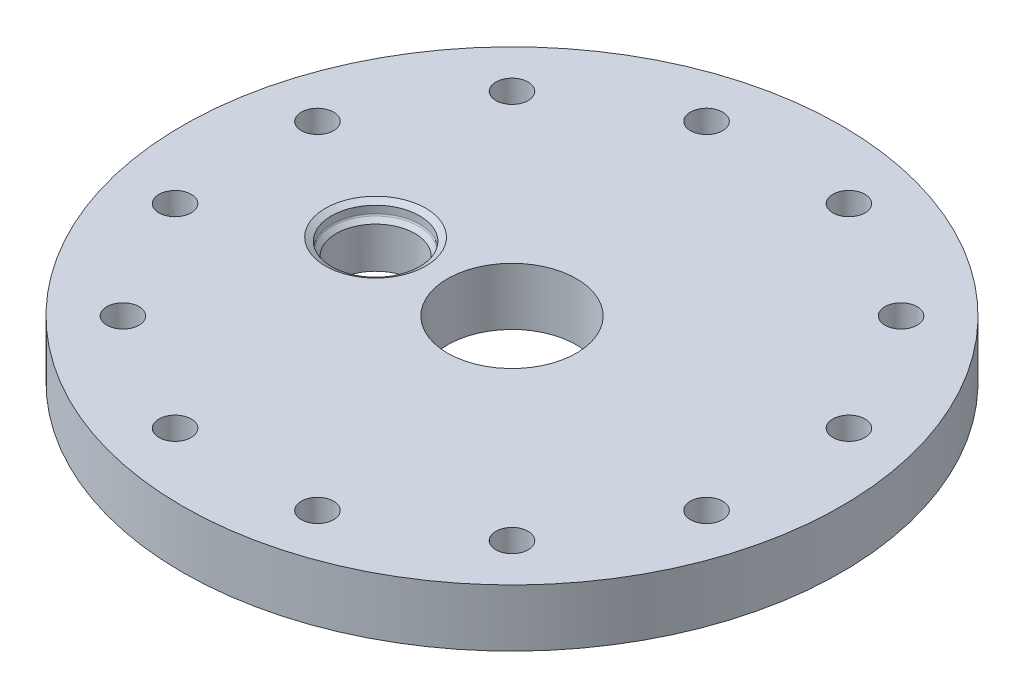
ISO-10303-21;
HEADER;
FILE_DESCRIPTION(('STEP AP214'),'2;1');
FILE_NAME('part.step','',(''),(''),'','','');
FILE_SCHEMA(('AUTOMOTIVE_DESIGN { 1 0 10303 214 1 1 1 1 }'));
ENDSEC;
DATA;
#1=APPLICATION_CONTEXT('core data for automotive mechanical design processes');
#2=APPLICATION_PROTOCOL_DEFINITION('international standard','automotive_design',2000,#1);
#3=PRODUCT_CONTEXT('',#1,'mechanical');
#4=PRODUCT('Part','Part','',(#3));
#5=PRODUCT_RELATED_PRODUCT_CATEGORY('part','',(#4));
#6=PRODUCT_DEFINITION_FORMATION('','',#4);
#7=PRODUCT_DEFINITION_CONTEXT('part definition',#1,'design');
#8=PRODUCT_DEFINITION('design','',#6,#7);
#9=PRODUCT_DEFINITION_SHAPE('','',#8);
#10=(LENGTH_UNIT() NAMED_UNIT(*) SI_UNIT(.MILLI.,.METRE.));
#11=(NAMED_UNIT(*) PLANE_ANGLE_UNIT() SI_UNIT($,.RADIAN.));
#12=(NAMED_UNIT(*) SI_UNIT($,.STERADIAN.) SOLID_ANGLE_UNIT());
#13=UNCERTAINTY_MEASURE_WITH_UNIT(LENGTH_MEASURE(1.E-05),#10,'distance_accuracy_value','');
#14=(GEOMETRIC_REPRESENTATION_CONTEXT(3) GLOBAL_UNCERTAINTY_ASSIGNED_CONTEXT((#13)) GLOBAL_UNIT_ASSIGNED_CONTEXT((#10,
#11,#12)) REPRESENTATION_CONTEXT('',''));
#15=CARTESIAN_POINT('',(0.,0.,0.));
#16=DIRECTION('',(0.,0.,1.));
#17=DIRECTION('',(1.,0.,0.));
#18=AXIS2_PLACEMENT_3D('',#15,#16,#17);
#19=CARTESIAN_POINT('',(-30.226,-0.000999999999999265,0.));
#20=DIRECTION('',(0.,1.,0.));
#21=DIRECTION('',(0.,0.,1.));
#22=AXIS2_PLACEMENT_3D('',#19,#20,#21);
#23=CYLINDRICAL_SURFACE('',#22,8.71220000000001);
#24=CARTESIAN_POINT('',(-30.226,0.,0.));
#25=DIRECTION('',(0.,1.,0.));
#26=DIRECTION('',(0.,0.,1.));
#27=AXIS2_PLACEMENT_3D('',#24,#25,#26);
#28=CIRCLE('',#27,8.71220000000001);
#29=CARTESIAN_POINT('',(-30.226,0.,8.71220000000001));
#30=VERTEX_POINT('',#29);
#31=EDGE_CURVE('E143',#30,#30,#28,.F.);
#32=ORIENTED_EDGE('',*,*,#31,.T.);
#33=EDGE_LOOP('',(#32));
#34=FACE_BOUND('',#33,.T.);
#35=CARTESIAN_POINT('',(-30.226,9.04787951031445,0.));
#36=DIRECTION('',(0.,-1.,0.));
#37=DIRECTION('',(0.,0.,-1.));
#38=AXIS2_PLACEMENT_3D('',#35,#36,#37);
#39=CIRCLE('',#38,8.71219999999999);
#40=CARTESIAN_POINT('',(-30.226,9.04787951031445,-8.71219999999999));
#41=VERTEX_POINT('',#40);
#42=EDGE_CURVE('E147',#41,#41,#39,.T.);
#43=ORIENTED_EDGE('',*,*,#42,.F.);
#44=EDGE_LOOP('',(#43));
#45=FACE_BOUND('',#44,.T.);
#46=ADVANCED_FACE('F50',(#34,#45),#23,.F.);
#47=CARTESIAN_POINT('',(0.,12.7,0.));
#48=DIRECTION('',(0.,-1.,0.));
#49=DIRECTION('',(0.,0.,-1.));
#50=AXIS2_PLACEMENT_3D('',#47,#48,#49);
#51=CYLINDRICAL_SURFACE('',#50,73.025);
#52=CARTESIAN_POINT('',(0.,12.7,0.));
#53=DIRECTION('',(0.,1.,0.));
#54=DIRECTION('',(0.,0.,1.));
#55=AXIS2_PLACEMENT_3D('',#52,#53,#54);
#56=CIRCLE('',#55,73.025);
#57=CARTESIAN_POINT('',(0.,12.7,73.025));
#58=VERTEX_POINT('',#57);
#59=EDGE_CURVE('E12',#58,#58,#56,.T.);
#60=ORIENTED_EDGE('',*,*,#59,.F.);
#61=EDGE_LOOP('',(#60));
#62=FACE_BOUND('',#61,.T.);
#63=CARTESIAN_POINT('',(0.,0.,0.));
#64=DIRECTION('',(0.,1.,0.));
#65=DIRECTION('',(0.,0.,1.));
#66=AXIS2_PLACEMENT_3D('',#63,#64,#65);
#67=CIRCLE('',#66,73.025);
#68=CARTESIAN_POINT('',(0.,0.,73.025));
#69=VERTEX_POINT('',#68);
#70=EDGE_CURVE('E54',#69,#69,#67,.T.);
#71=ORIENTED_EDGE('',*,*,#70,.T.);
#72=EDGE_LOOP('',(#71));
#73=FACE_BOUND('',#72,.T.);
#74=ADVANCED_FACE('F52',(#62,#73),#51,.T.);
#75=CARTESIAN_POINT('',(0.,12.7,0.));
#76=DIRECTION('',(0.,1.,0.));
#77=DIRECTION('',(0.,0.,1.));
#78=AXIS2_PLACEMENT_3D('',#75,#76,#77);
#79=PLANE('',#78);
#80=CARTESIAN_POINT('',(-30.226,12.7,0.));
#81=DIRECTION('',(0.,-1.,0.));
#82=DIRECTION('',(0.,0.,-1.));
#83=AXIS2_PLACEMENT_3D('',#80,#81,#82);
#84=CIRCLE('',#83,11.1125);
#85=CARTESIAN_POINT('',(-30.226,12.7,-11.1125));
#86=VERTEX_POINT('',#85);
#87=EDGE_CURVE('E159',#86,#86,#84,.T.);
#88=ORIENTED_EDGE('',*,*,#87,.T.);
#89=EDGE_LOOP('',(#88));
#90=FACE_BOUND('',#89,.T.);
#91=CARTESIAN_POINT('',(-58.8828383705818,12.7,15.7776089894489));
#92=DIRECTION('',(0.,1.,0.));
#93=DIRECTION('',(0.499999999999989,0.,0.866025403784445));
#94=AXIS2_PLACEMENT_3D('',#91,#92,#93);
#95=CIRCLE('',#94,3.571875);
#96=CARTESIAN_POINT('',(-57.0969008705819,12.7,18.8709434785914));
#97=VERTEX_POINT('',#96);
#98=EDGE_CURVE('E140',#97,#97,#95,.T.);
#99=ORIENTED_EDGE('',*,*,#98,.F.);
#100=EDGE_LOOP('',(#99));
#101=FACE_BOUND('',#100,.T.);
#102=CARTESIAN_POINT('',(-43.1052293811325,12.7,43.1052293811314));
#103=DIRECTION('',(0.,1.,0.));
#104=DIRECTION('',(0.866025403784433,0.,0.50000000000001));
#105=AXIS2_PLACEMENT_3D('',#102,#103,#104);
#106=CIRCLE('',#105,3.571875);
#107=CARTESIAN_POINT('',(-40.0118948919899,12.7,44.8911668811314));
#108=VERTEX_POINT('',#107);
#109=EDGE_CURVE('E132',#108,#108,#106,.T.);
#110=ORIENTED_EDGE('',*,*,#109,.F.);
#111=EDGE_LOOP('',(#110));
#112=FACE_BOUND('',#111,.T.);
#113=CARTESIAN_POINT('',(-15.7776089894503,12.7,58.8828383705814));
#114=DIRECTION('',(0.,1.,0.));
#115=DIRECTION('',(1.,0.,0.));
#116=AXIS2_PLACEMENT_3D('',#113,#114,#115);
#117=CIRCLE('',#116,3.571875);
#118=CARTESIAN_POINT('',(-12.2057339894503,12.7,58.8828383705815));
#119=VERTEX_POINT('',#118);
#120=EDGE_CURVE('E126',#119,#119,#117,.T.);
#121=ORIENTED_EDGE('',*,*,#120,.F.);
#122=EDGE_LOOP('',(#121));
#123=FACE_BOUND('',#122,.T.);
#124=CARTESIAN_POINT('',(15.7776089894491,12.7,58.8828383705818));
#125=DIRECTION('',(0.,1.,0.));
#126=DIRECTION('',(0.866025403784443,0.,-0.499999999999992));
#127=AXIS2_PLACEMENT_3D('',#124,#125,#126);
#128=CIRCLE('',#127,3.571875);
#129=CARTESIAN_POINT('',(18.8709434785916,12.7,57.0969008705818));
#130=VERTEX_POINT('',#129);
#131=EDGE_CURVE('E120',#130,#130,#128,.T.);
#132=ORIENTED_EDGE('',*,*,#131,.F.);
#133=EDGE_LOOP('',(#132));
#134=FACE_BOUND('',#133,.T.);
#135=CARTESIAN_POINT('',(43.1052293811316,12.7,43.1052293811323));
#136=DIRECTION('',(0.,1.,0.));
#137=DIRECTION('',(0.500000000000007,0.,-0.866025403784435));
#138=AXIS2_PLACEMENT_3D('',#135,#136,#137);
#139=CIRCLE('',#138,3.571875);
#140=CARTESIAN_POINT('',(44.8911668811316,12.7,40.0118948919898));
#141=VERTEX_POINT('',#140);
#142=EDGE_CURVE('E114',#141,#141,#139,.T.);
#143=ORIENTED_EDGE('',*,*,#142,.F.);
#144=EDGE_LOOP('',(#143));
#145=FACE_BOUND('',#144,.T.);
#146=CARTESIAN_POINT('',(58.8828383705815,12.7,15.7776089894501));
#147=DIRECTION('',(0.,1.,0.));
#148=DIRECTION('',(0.,0.,-1.));
#149=AXIS2_PLACEMENT_3D('',#146,#147,#148);
#150=CIRCLE('',#149,3.571875);
#151=CARTESIAN_POINT('',(58.8828383705815,12.7,12.2057339894501));
#152=VERTEX_POINT('',#151);
#153=EDGE_CURVE('E108',#152,#152,#150,.T.);
#154=ORIENTED_EDGE('',*,*,#153,.F.);
#155=EDGE_LOOP('',(#154));
#156=FACE_BOUND('',#155,.T.);
#157=CARTESIAN_POINT('',(58.8828383705817,12.7,-15.7776089894493));
#158=DIRECTION('',(0.,1.,0.));
#159=DIRECTION('',(-0.499999999999995,0.,-0.866025403784442));
#160=AXIS2_PLACEMENT_3D('',#157,#158,#159);
#161=CIRCLE('',#160,3.571875);
#162=CARTESIAN_POINT('',(57.0969008705817,12.7,-18.8709434785918));
#163=VERTEX_POINT('',#162);
#164=EDGE_CURVE('E102',#163,#163,#161,.T.);
#165=ORIENTED_EDGE('',*,*,#164,.F.);
#166=EDGE_LOOP('',(#165));
#167=FACE_BOUND('',#166,.T.);
#168=CARTESIAN_POINT('',(43.1052293811322,12.7,-43.1052293811317));
#169=DIRECTION('',(0.,1.,0.));
#170=DIRECTION('',(-0.866025403784436,0.,-0.500000000000004));
#171=AXIS2_PLACEMENT_3D('',#168,#169,#170);
#172=CIRCLE('',#171,3.571875);
#173=CARTESIAN_POINT('',(40.0118948919896,12.7,-44.8911668811317));
#174=VERTEX_POINT('',#173);
#175=EDGE_CURVE('E96',#174,#174,#172,.T.);
#176=ORIENTED_EDGE('',*,*,#175,.F.);
#177=EDGE_LOOP('',(#176));
#178=FACE_BOUND('',#177,.T.);
#179=CARTESIAN_POINT('',(15.7776089894499,12.7,-58.8828383705815));
#180=DIRECTION('',(0.,1.,0.));
#181=DIRECTION('',(-1.,0.,0.));
#182=AXIS2_PLACEMENT_3D('',#179,#180,#181);
#183=CIRCLE('',#182,3.571875);
#184=CARTESIAN_POINT('',(12.2057339894499,12.7,-58.8828383705816));
#185=VERTEX_POINT('',#184);
#186=EDGE_CURVE('E90',#185,#185,#183,.T.);
#187=ORIENTED_EDGE('',*,*,#186,.F.);
#188=EDGE_LOOP('',(#187));
#189=FACE_BOUND('',#188,.T.);
#190=CARTESIAN_POINT('',(-15.7776089894495,12.7,-58.8828383705817));
#191=DIRECTION('',(0.,1.,0.));
#192=DIRECTION('',(-0.86602540378444,0.,0.499999999999998));
#193=AXIS2_PLACEMENT_3D('',#190,#191,#192);
#194=CIRCLE('',#193,3.571875);
#195=CARTESIAN_POINT('',(-18.870943478592,12.7,-57.0969008705817));
#196=VERTEX_POINT('',#195);
#197=EDGE_CURVE('E84',#196,#196,#194,.T.);
#198=ORIENTED_EDGE('',*,*,#197,.F.);
#199=EDGE_LOOP('',(#198));
#200=FACE_BOUND('',#199,.T.);
#201=CARTESIAN_POINT('',(-43.1052293811319,12.7,-43.105229381132));
#202=DIRECTION('',(0.,1.,0.));
#203=DIRECTION('',(-0.500000000000001,0.,0.866025403784438));
#204=AXIS2_PLACEMENT_3D('',#201,#202,#203);
#205=CIRCLE('',#204,3.571875);
#206=CARTESIAN_POINT('',(-44.8911668811319,12.7,-40.0118948919895));
#207=VERTEX_POINT('',#206);
#208=EDGE_CURVE('E78',#207,#207,#205,.T.);
#209=ORIENTED_EDGE('',*,*,#208,.F.);
#210=EDGE_LOOP('',(#209));
#211=FACE_BOUND('',#210,.T.);
#212=CARTESIAN_POINT('',(-58.8828383705816,12.7,-15.7776089894497));
#213=DIRECTION('',(0.,1.,0.));
#214=DIRECTION('',(0.,0.,1.));
#215=AXIS2_PLACEMENT_3D('',#212,#213,#214);
#216=CIRCLE('',#215,3.571875);
#217=CARTESIAN_POINT('',(-58.8828383705816,12.7,-12.2057339894497));
#218=VERTEX_POINT('',#217);
#219=EDGE_CURVE('E72',#218,#218,#216,.T.);
#220=ORIENTED_EDGE('',*,*,#219,.F.);
#221=EDGE_LOOP('',(#220));
#222=FACE_BOUND('',#221,.T.);
#223=CARTESIAN_POINT('',(0.,12.7,0.));
#224=DIRECTION('',(0.,1.,0.));
#225=DIRECTION('',(0.,0.,1.));
#226=AXIS2_PLACEMENT_3D('',#223,#224,#225);
#227=CIRCLE('',#226,14.2875);
#228=CARTESIAN_POINT('',(0.,12.7,14.2875));
#229=VERTEX_POINT('',#228);
#230=EDGE_CURVE('E63',#229,#229,#227,.T.);
#231=ORIENTED_EDGE('',*,*,#230,.F.);
#232=EDGE_LOOP('',(#231));
#233=FACE_BOUND('',#232,.T.);
#234=ORIENTED_EDGE('',*,*,#59,.T.);
#235=EDGE_LOOP('',(#234));
#236=FACE_BOUND('',#235,.T.);
#237=ADVANCED_FACE('F163',(#90,#101,#112,#123,#134,#145,#156,#167,#178,#189,#200,#211,#222,#233,
#236),#79,.T.);
#238=CARTESIAN_POINT('',(0.,0.,0.));
#239=DIRECTION('',(0.,1.,0.));
#240=DIRECTION('',(0.,0.,1.));
#241=AXIS2_PLACEMENT_3D('',#238,#239,#240);
#242=PLANE('',#241);
#243=ORIENTED_EDGE('',*,*,#31,.F.);
#244=EDGE_LOOP('',(#243));
#245=FACE_BOUND('',#244,.T.);
#246=CARTESIAN_POINT('',(-58.8828383705818,0.,15.7776089894489));
#247=DIRECTION('',(0.,1.,0.));
#248=DIRECTION('',(0.,0.,1.));
#249=AXIS2_PLACEMENT_3D('',#246,#247,#248);
#250=CIRCLE('',#249,3.571875);
#251=CARTESIAN_POINT('',(-58.8828383705818,0.,19.3494839894489));
#252=VERTEX_POINT('',#251);
#253=EDGE_CURVE('E136',#252,#252,#250,.F.);
#254=ORIENTED_EDGE('',*,*,#253,.F.);
#255=EDGE_LOOP('',(#254));
#256=FACE_BOUND('',#255,.T.);
#257=CARTESIAN_POINT('',(-43.1052293811325,0.,43.1052293811314));
#258=DIRECTION('',(0.,1.,0.));
#259=DIRECTION('',(0.,0.,1.));
#260=AXIS2_PLACEMENT_3D('',#257,#258,#259);
#261=CIRCLE('',#260,3.571875);
#262=CARTESIAN_POINT('',(-43.1052293811325,0.,46.6771043811314));
#263=VERTEX_POINT('',#262);
#264=EDGE_CURVE('E129',#263,#263,#261,.F.);
#265=ORIENTED_EDGE('',*,*,#264,.F.);
#266=EDGE_LOOP('',(#265));
#267=FACE_BOUND('',#266,.T.);
#268=CARTESIAN_POINT('',(-15.7776089894503,0.,58.8828383705814));
#269=DIRECTION('',(0.,1.,0.));
#270=DIRECTION('',(0.,0.,1.));
#271=AXIS2_PLACEMENT_3D('',#268,#269,#270);
#272=CIRCLE('',#271,3.571875);
#273=CARTESIAN_POINT('',(-15.7776089894503,0.,62.4547133705814));
#274=VERTEX_POINT('',#273);
#275=EDGE_CURVE('E123',#274,#274,#272,.F.);
#276=ORIENTED_EDGE('',*,*,#275,.F.);
#277=EDGE_LOOP('',(#276));
#278=FACE_BOUND('',#277,.T.);
#279=CARTESIAN_POINT('',(15.7776089894491,0.,58.8828383705818));
#280=DIRECTION('',(0.,1.,0.));
#281=DIRECTION('',(0.,0.,1.));
#282=AXIS2_PLACEMENT_3D('',#279,#280,#281);
#283=CIRCLE('',#282,3.571875);
#284=CARTESIAN_POINT('',(15.7776089894491,0.,62.4547133705818));
#285=VERTEX_POINT('',#284);
#286=EDGE_CURVE('E117',#285,#285,#283,.F.);
#287=ORIENTED_EDGE('',*,*,#286,.F.);
#288=EDGE_LOOP('',(#287));
#289=FACE_BOUND('',#288,.T.);
#290=CARTESIAN_POINT('',(43.1052293811316,0.,43.1052293811323));
#291=DIRECTION('',(0.,1.,0.));
#292=DIRECTION('',(0.,0.,1.));
#293=AXIS2_PLACEMENT_3D('',#290,#291,#292);
#294=CIRCLE('',#293,3.571875);
#295=CARTESIAN_POINT('',(43.1052293811316,0.,46.6771043811323));
#296=VERTEX_POINT('',#295);
#297=EDGE_CURVE('E111',#296,#296,#294,.F.);
#298=ORIENTED_EDGE('',*,*,#297,.F.);
#299=EDGE_LOOP('',(#298));
#300=FACE_BOUND('',#299,.T.);
#301=CARTESIAN_POINT('',(58.8828383705815,0.,15.7776089894501));
#302=DIRECTION('',(0.,1.,0.));
#303=DIRECTION('',(0.,0.,1.));
#304=AXIS2_PLACEMENT_3D('',#301,#302,#303);
#305=CIRCLE('',#304,3.571875);
#306=CARTESIAN_POINT('',(58.8828383705815,0.,19.3494839894501));
#307=VERTEX_POINT('',#306);
#308=EDGE_CURVE('E105',#307,#307,#305,.F.);
#309=ORIENTED_EDGE('',*,*,#308,.F.);
#310=EDGE_LOOP('',(#309));
#311=FACE_BOUND('',#310,.T.);
#312=CARTESIAN_POINT('',(58.8828383705817,0.,-15.7776089894493));
#313=DIRECTION('',(0.,1.,0.));
#314=DIRECTION('',(0.,0.,1.));
#315=AXIS2_PLACEMENT_3D('',#312,#313,#314);
#316=CIRCLE('',#315,3.571875);
#317=CARTESIAN_POINT('',(58.8828383705817,0.,-12.2057339894493));
#318=VERTEX_POINT('',#317);
#319=EDGE_CURVE('E99',#318,#318,#316,.F.);
#320=ORIENTED_EDGE('',*,*,#319,.F.);
#321=EDGE_LOOP('',(#320));
#322=FACE_BOUND('',#321,.T.);
#323=CARTESIAN_POINT('',(43.1052293811322,0.,-43.1052293811317));
#324=DIRECTION('',(0.,1.,0.));
#325=DIRECTION('',(0.,0.,1.));
#326=AXIS2_PLACEMENT_3D('',#323,#324,#325);
#327=CIRCLE('',#326,3.571875);
#328=CARTESIAN_POINT('',(43.1052293811322,0.,-39.5333543811317));
#329=VERTEX_POINT('',#328);
#330=EDGE_CURVE('E93',#329,#329,#327,.F.);
#331=ORIENTED_EDGE('',*,*,#330,.F.);
#332=EDGE_LOOP('',(#331));
#333=FACE_BOUND('',#332,.T.);
#334=CARTESIAN_POINT('',(15.7776089894499,0.,-58.8828383705815));
#335=DIRECTION('',(0.,1.,0.));
#336=DIRECTION('',(0.,0.,1.));
#337=AXIS2_PLACEMENT_3D('',#334,#335,#336);
#338=CIRCLE('',#337,3.571875);
#339=CARTESIAN_POINT('',(15.7776089894499,0.,-55.3109633705815));
#340=VERTEX_POINT('',#339);
#341=EDGE_CURVE('E87',#340,#340,#338,.F.);
#342=ORIENTED_EDGE('',*,*,#341,.F.);
#343=EDGE_LOOP('',(#342));
#344=FACE_BOUND('',#343,.T.);
#345=CARTESIAN_POINT('',(-15.7776089894495,0.,-58.8828383705817));
#346=DIRECTION('',(0.,1.,0.));
#347=DIRECTION('',(0.,0.,1.));
#348=AXIS2_PLACEMENT_3D('',#345,#346,#347);
#349=CIRCLE('',#348,3.571875);
#350=CARTESIAN_POINT('',(-15.7776089894495,0.,-55.3109633705817));
#351=VERTEX_POINT('',#350);
#352=EDGE_CURVE('E81',#351,#351,#349,.F.);
#353=ORIENTED_EDGE('',*,*,#352,.F.);
#354=EDGE_LOOP('',(#353));
#355=FACE_BOUND('',#354,.T.);
#356=CARTESIAN_POINT('',(-43.1052293811319,0.,-43.105229381132));
#357=DIRECTION('',(0.,1.,0.));
#358=DIRECTION('',(0.,0.,1.));
#359=AXIS2_PLACEMENT_3D('',#356,#357,#358);
#360=CIRCLE('',#359,3.571875);
#361=CARTESIAN_POINT('',(-43.1052293811319,0.,-39.533354381132));
#362=VERTEX_POINT('',#361);
#363=EDGE_CURVE('E75',#362,#362,#360,.F.);
#364=ORIENTED_EDGE('',*,*,#363,.F.);
#365=EDGE_LOOP('',(#364));
#366=FACE_BOUND('',#365,.T.);
#367=CARTESIAN_POINT('',(-58.8828383705816,0.,-15.7776089894497));
#368=DIRECTION('',(0.,1.,0.));
#369=DIRECTION('',(0.,0.,1.));
#370=AXIS2_PLACEMENT_3D('',#367,#368,#369);
#371=CIRCLE('',#370,3.571875);
#372=CARTESIAN_POINT('',(-58.8828383705816,0.,-12.2057339894497));
#373=VERTEX_POINT('',#372);
#374=EDGE_CURVE('E66',#373,#373,#371,.F.);
#375=ORIENTED_EDGE('',*,*,#374,.F.);
#376=EDGE_LOOP('',(#375));
#377=FACE_BOUND('',#376,.T.);
#378=CARTESIAN_POINT('',(0.,0.,0.));
#379=DIRECTION('',(0.,1.,0.));
#380=DIRECTION('',(0.,0.,1.));
#381=AXIS2_PLACEMENT_3D('',#378,#379,#380);
#382=CIRCLE('',#381,14.2875);
#383=CARTESIAN_POINT('',(0.,0.,14.2875));
#384=VERTEX_POINT('',#383);
#385=EDGE_CURVE('E61',#384,#384,#382,.T.);
#386=ORIENTED_EDGE('',*,*,#385,.T.);
#387=EDGE_LOOP('',(#386));
#388=FACE_BOUND('',#387,.T.);
#389=ORIENTED_EDGE('',*,*,#70,.F.);
#390=EDGE_LOOP('',(#389));
#391=FACE_BOUND('',#390,.T.);
#392=ADVANCED_FACE('F241',(#245,#256,#267,#278,#289,#300,#311,#322,#333,#344,#355,#366,#377,
#388,#391),#242,.F.);
#393=CARTESIAN_POINT('',(0.,0.,0.));
#394=DIRECTION('',(0.,1.,0.));
#395=DIRECTION('',(0.,0.,1.));
#396=AXIS2_PLACEMENT_3D('',#393,#394,#395);
#397=CYLINDRICAL_SURFACE('',#396,14.2875);
#398=ORIENTED_EDGE('',*,*,#385,.F.);
#399=EDGE_LOOP('',(#398));
#400=FACE_BOUND('',#399,.T.);
#401=ORIENTED_EDGE('',*,*,#230,.T.);
#402=EDGE_LOOP('',(#401));
#403=FACE_BOUND('',#402,.T.);
#404=ADVANCED_FACE('F237',(#400,#403),#397,.F.);
#405=CARTESIAN_POINT('',(-58.8828383705816,-0.000999999999999265,-15.7776089894497));
#406=DIRECTION('',(0.,1.,0.));
#407=DIRECTION('',(0.,0.,1.));
#408=AXIS2_PLACEMENT_3D('',#405,#406,#407);
#409=CYLINDRICAL_SURFACE('',#408,3.571875);
#410=ORIENTED_EDGE('',*,*,#219,.T.);
#411=EDGE_LOOP('',(#410));
#412=FACE_BOUND('',#411,.T.);
#413=ORIENTED_EDGE('',*,*,#374,.T.);
#414=EDGE_LOOP('',(#413));
#415=FACE_BOUND('',#414,.T.);
#416=ADVANCED_FACE('F233',(#412,#415),#409,.F.);
#417=CARTESIAN_POINT('',(-43.1052293811319,-0.000999999999999265,-43.105229381132));
#418=DIRECTION('',(0.,1.,0.));
#419=DIRECTION('',(0.,0.,1.));
#420=AXIS2_PLACEMENT_3D('',#417,#418,#419);
#421=CYLINDRICAL_SURFACE('',#420,3.571875);
#422=ORIENTED_EDGE('',*,*,#208,.T.);
#423=EDGE_LOOP('',(#422));
#424=FACE_BOUND('',#423,.T.);
#425=ORIENTED_EDGE('',*,*,#363,.T.);
#426=EDGE_LOOP('',(#425));
#427=FACE_BOUND('',#426,.T.);
#428=ADVANCED_FACE('F229',(#424,#427),#421,.F.);
#429=CARTESIAN_POINT('',(-15.7776089894495,-0.000999999999999265,-58.8828383705817));
#430=DIRECTION('',(0.,1.,0.));
#431=DIRECTION('',(0.,0.,1.));
#432=AXIS2_PLACEMENT_3D('',#429,#430,#431);
#433=CYLINDRICAL_SURFACE('',#432,3.571875);
#434=ORIENTED_EDGE('',*,*,#197,.T.);
#435=EDGE_LOOP('',(#434));
#436=FACE_BOUND('',#435,.T.);
#437=ORIENTED_EDGE('',*,*,#352,.T.);
#438=EDGE_LOOP('',(#437));
#439=FACE_BOUND('',#438,.T.);
#440=ADVANCED_FACE('F225',(#436,#439),#433,.F.);
#441=CARTESIAN_POINT('',(15.7776089894499,-0.000999999999999265,-58.8828383705815));
#442=DIRECTION('',(0.,1.,0.));
#443=DIRECTION('',(0.,0.,1.));
#444=AXIS2_PLACEMENT_3D('',#441,#442,#443);
#445=CYLINDRICAL_SURFACE('',#444,3.571875);
#446=ORIENTED_EDGE('',*,*,#186,.T.);
#447=EDGE_LOOP('',(#446));
#448=FACE_BOUND('',#447,.T.);
#449=ORIENTED_EDGE('',*,*,#341,.T.);
#450=EDGE_LOOP('',(#449));
#451=FACE_BOUND('',#450,.T.);
#452=ADVANCED_FACE('F221',(#448,#451),#445,.F.);
#453=CARTESIAN_POINT('',(43.1052293811322,-0.000999999999999265,-43.1052293811317));
#454=DIRECTION('',(0.,1.,0.));
#455=DIRECTION('',(0.,0.,1.));
#456=AXIS2_PLACEMENT_3D('',#453,#454,#455);
#457=CYLINDRICAL_SURFACE('',#456,3.571875);
#458=ORIENTED_EDGE('',*,*,#175,.T.);
#459=EDGE_LOOP('',(#458));
#460=FACE_BOUND('',#459,.T.);
#461=ORIENTED_EDGE('',*,*,#330,.T.);
#462=EDGE_LOOP('',(#461));
#463=FACE_BOUND('',#462,.T.);
#464=ADVANCED_FACE('F217',(#460,#463),#457,.F.);
#465=CARTESIAN_POINT('',(58.8828383705817,-0.000999999999999265,-15.7776089894493));
#466=DIRECTION('',(0.,1.,0.));
#467=DIRECTION('',(0.,0.,1.));
#468=AXIS2_PLACEMENT_3D('',#465,#466,#467);
#469=CYLINDRICAL_SURFACE('',#468,3.571875);
#470=ORIENTED_EDGE('',*,*,#164,.T.);
#471=EDGE_LOOP('',(#470));
#472=FACE_BOUND('',#471,.T.);
#473=ORIENTED_EDGE('',*,*,#319,.T.);
#474=EDGE_LOOP('',(#473));
#475=FACE_BOUND('',#474,.T.);
#476=ADVANCED_FACE('F213',(#472,#475),#469,.F.);
#477=CARTESIAN_POINT('',(58.8828383705815,-0.000999999999999265,15.7776089894501));
#478=DIRECTION('',(0.,1.,0.));
#479=DIRECTION('',(0.,0.,1.));
#480=AXIS2_PLACEMENT_3D('',#477,#478,#479);
#481=CYLINDRICAL_SURFACE('',#480,3.571875);
#482=ORIENTED_EDGE('',*,*,#153,.T.);
#483=EDGE_LOOP('',(#482));
#484=FACE_BOUND('',#483,.T.);
#485=ORIENTED_EDGE('',*,*,#308,.T.);
#486=EDGE_LOOP('',(#485));
#487=FACE_BOUND('',#486,.T.);
#488=ADVANCED_FACE('F209',(#484,#487),#481,.F.);
#489=CARTESIAN_POINT('',(43.1052293811316,-0.000999999999999265,43.1052293811323));
#490=DIRECTION('',(0.,1.,0.));
#491=DIRECTION('',(0.,0.,1.));
#492=AXIS2_PLACEMENT_3D('',#489,#490,#491);
#493=CYLINDRICAL_SURFACE('',#492,3.571875);
#494=ORIENTED_EDGE('',*,*,#142,.T.);
#495=EDGE_LOOP('',(#494));
#496=FACE_BOUND('',#495,.T.);
#497=ORIENTED_EDGE('',*,*,#297,.T.);
#498=EDGE_LOOP('',(#497));
#499=FACE_BOUND('',#498,.T.);
#500=ADVANCED_FACE('F205',(#496,#499),#493,.F.);
#501=CARTESIAN_POINT('',(15.7776089894491,-0.000999999999999265,58.8828383705818));
#502=DIRECTION('',(0.,1.,0.));
#503=DIRECTION('',(0.,0.,1.));
#504=AXIS2_PLACEMENT_3D('',#501,#502,#503);
#505=CYLINDRICAL_SURFACE('',#504,3.571875);
#506=ORIENTED_EDGE('',*,*,#131,.T.);
#507=EDGE_LOOP('',(#506));
#508=FACE_BOUND('',#507,.T.);
#509=ORIENTED_EDGE('',*,*,#286,.T.);
#510=EDGE_LOOP('',(#509));
#511=FACE_BOUND('',#510,.T.);
#512=ADVANCED_FACE('F201',(#508,#511),#505,.F.);
#513=CARTESIAN_POINT('',(-15.7776089894503,-0.000999999999999265,58.8828383705814));
#514=DIRECTION('',(0.,1.,0.));
#515=DIRECTION('',(0.,0.,1.));
#516=AXIS2_PLACEMENT_3D('',#513,#514,#515);
#517=CYLINDRICAL_SURFACE('',#516,3.571875);
#518=ORIENTED_EDGE('',*,*,#120,.T.);
#519=EDGE_LOOP('',(#518));
#520=FACE_BOUND('',#519,.T.);
#521=ORIENTED_EDGE('',*,*,#275,.T.);
#522=EDGE_LOOP('',(#521));
#523=FACE_BOUND('',#522,.T.);
#524=ADVANCED_FACE('F197',(#520,#523),#517,.F.);
#525=CARTESIAN_POINT('',(-43.1052293811325,-0.000999999999999265,43.1052293811314));
#526=DIRECTION('',(0.,1.,0.));
#527=DIRECTION('',(0.,0.,1.));
#528=AXIS2_PLACEMENT_3D('',#525,#526,#527);
#529=CYLINDRICAL_SURFACE('',#528,3.571875);
#530=ORIENTED_EDGE('',*,*,#109,.T.);
#531=EDGE_LOOP('',(#530));
#532=FACE_BOUND('',#531,.T.);
#533=ORIENTED_EDGE('',*,*,#264,.T.);
#534=EDGE_LOOP('',(#533));
#535=FACE_BOUND('',#534,.T.);
#536=ADVANCED_FACE('F193',(#532,#535),#529,.F.);
#537=CARTESIAN_POINT('',(-58.8828383705818,-0.000999999999999265,15.7776089894489));
#538=DIRECTION('',(0.,1.,0.));
#539=DIRECTION('',(0.,0.,1.));
#540=AXIS2_PLACEMENT_3D('',#537,#538,#539);
#541=CYLINDRICAL_SURFACE('',#540,3.571875);
#542=ORIENTED_EDGE('',*,*,#98,.T.);
#543=EDGE_LOOP('',(#542));
#544=FACE_BOUND('',#543,.T.);
#545=ORIENTED_EDGE('',*,*,#253,.T.);
#546=EDGE_LOOP('',(#545));
#547=FACE_BOUND('',#546,.T.);
#548=ADVANCED_FACE('F190',(#544,#547),#541,.F.);
#549=CARTESIAN_POINT('',(-30.226,9.95318975515723,0.));
#550=DIRECTION('',(0.,1.,0.));
#551=DIRECTION('',(0.,0.,1.));
#552=AXIS2_PLACEMENT_3D('',#549,#550,#551);
#553=CONICAL_SURFACE('',#552,9.61751024484274,0.785398163397429);
#554=ORIENTED_EDGE('',*,*,#42,.T.);
#555=EDGE_LOOP('',(#554));
#556=FACE_BOUND('',#555,.T.);
#557=CARTESIAN_POINT('',(-30.226,9.95318975515723,0.));
#558=DIRECTION('',(0.,-1.,0.));
#559=DIRECTION('',(0.,0.,-1.));
#560=AXIS2_PLACEMENT_3D('',#557,#558,#559);
#561=CIRCLE('',#560,9.61751024484274);
#562=CARTESIAN_POINT('',(-30.226,9.95318975515723,-9.61751024484274));
#563=VERTEX_POINT('',#562);
#564=EDGE_CURVE('E150',#563,#563,#561,.T.);
#565=ORIENTED_EDGE('',*,*,#564,.F.);
#566=EDGE_LOOP('',(#565));
#567=FACE_BOUND('',#566,.T.);
#568=ADVANCED_FACE('F188',(#556,#567),#553,.F.);
#569=CARTESIAN_POINT('',(-30.226,10.3124,0.));
#570=DIRECTION('',(0.,-1.,0.));
#571=DIRECTION('',(0.,0.,-1.));
#572=AXIS2_PLACEMENT_3D('',#569,#570,#571);
#573=TOROIDAL_SURFACE('',#572,9.25829999999998,0.507999999999997);
#574=ORIENTED_EDGE('',*,*,#564,.T.);
#575=EDGE_LOOP('',(#574));
#576=FACE_BOUND('',#575,.T.);
#577=CARTESIAN_POINT('',(-30.226,10.3124,0.));
#578=DIRECTION('',(0.,-1.,0.));
#579=DIRECTION('',(0.,0.,-1.));
#580=AXIS2_PLACEMENT_3D('',#577,#578,#579);
#581=CIRCLE('',#580,9.76629999999997);
#582=CARTESIAN_POINT('',(-30.226,10.3124,-9.76629999999997));
#583=VERTEX_POINT('',#582);
#584=EDGE_CURVE('E153',#583,#583,#581,.T.);
#585=ORIENTED_EDGE('',*,*,#584,.F.);
#586=EDGE_LOOP('',(#585));
#587=FACE_BOUND('',#586,.T.);
#588=ADVANCED_FACE('F174',(#576,#587),#573,.F.);
#589=CARTESIAN_POINT('',(-30.226,-7.46888199469763,0.));
#590=DIRECTION('',(0.,-1.,0.));
#591=DIRECTION('',(0.,0.,-1.));
#592=AXIS2_PLACEMENT_3D('',#589,#590,#591);
#593=CYLINDRICAL_SURFACE('',#592,9.76629999999998);
#594=ORIENTED_EDGE('',*,*,#584,.T.);
#595=EDGE_LOOP('',(#594));
#596=FACE_BOUND('',#595,.T.);
#597=CARTESIAN_POINT('',(-30.226,11.9227710676169,0.));
#598=DIRECTION('',(0.,-1.,0.));
#599=DIRECTION('',(0.,0.,-1.));
#600=AXIS2_PLACEMENT_3D('',#597,#598,#599);
#601=CIRCLE('',#600,9.76629999999998);
#602=CARTESIAN_POINT('',(-30.226,11.9227710676169,-9.76629999999998));
#603=VERTEX_POINT('',#602);
#604=EDGE_CURVE('E156',#603,#603,#601,.T.);
#605=ORIENTED_EDGE('',*,*,#604,.F.);
#606=EDGE_LOOP('',(#605));
#607=FACE_BOUND('',#606,.T.);
#608=ADVANCED_FACE('F168',(#596,#607),#593,.F.);
#609=CARTESIAN_POINT('',(-30.226,12.7,0.));
#610=DIRECTION('',(0.,1.,0.));
#611=DIRECTION('',(0.,0.,1.));
#612=AXIS2_PLACEMENT_3D('',#609,#610,#611);
#613=CONICAL_SURFACE('',#612,11.1125,1.0471975511966);
#614=ORIENTED_EDGE('',*,*,#604,.T.);
#615=EDGE_LOOP('',(#614));
#616=FACE_BOUND('',#615,.T.);
#617=ORIENTED_EDGE('',*,*,#87,.F.);
#618=EDGE_LOOP('',(#617));
#619=FACE_BOUND('',#618,.T.);
#620=ADVANCED_FACE('F166',(#616,#619),#613,.F.);
#621=CLOSED_SHELL('',(#46,#74,#237,#392,#404,#416,#428,#440,#452,#464,#476,#488,#500,#512,#524,
#536,#548,#568,#588,#608,#620));
#622=MANIFOLD_SOLID_BREP('B2',#621);
#623=ADVANCED_BREP_SHAPE_REPRESENTATION('',(#18,#622),#14);
#624=SHAPE_DEFINITION_REPRESENTATION(#9,#623);
ENDSEC;
END-ISO-10303-21;
